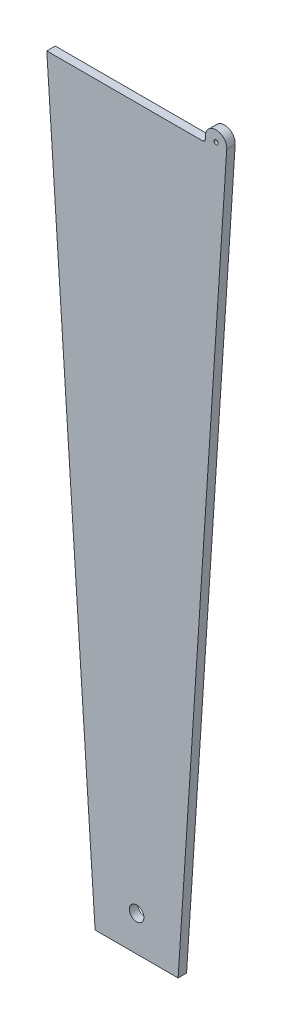
ISO-10303-21;
HEADER;
FILE_DESCRIPTION(('STEP AP214'),'2;1');
FILE_NAME('part.step','',(''),(''),'','','');
FILE_SCHEMA(('AUTOMOTIVE_DESIGN { 1 0 10303 214 1 1 1 1 }'));
ENDSEC;
DATA;
#1=APPLICATION_CONTEXT('core data for automotive mechanical design processes');
#2=APPLICATION_PROTOCOL_DEFINITION('international standard','automotive_design',2000,#1);
#3=PRODUCT_CONTEXT('',#1,'mechanical');
#4=PRODUCT('Part','Part','',(#3));
#5=PRODUCT_RELATED_PRODUCT_CATEGORY('part','',(#4));
#6=PRODUCT_DEFINITION_FORMATION('','',#4);
#7=PRODUCT_DEFINITION_CONTEXT('part definition',#1,'design');
#8=PRODUCT_DEFINITION('design','',#6,#7);
#9=PRODUCT_DEFINITION_SHAPE('','',#8);
#10=(LENGTH_UNIT() NAMED_UNIT(*) SI_UNIT(.MILLI.,.METRE.));
#11=(NAMED_UNIT(*) PLANE_ANGLE_UNIT() SI_UNIT($,.RADIAN.));
#12=(NAMED_UNIT(*) SI_UNIT($,.STERADIAN.) SOLID_ANGLE_UNIT());
#13=UNCERTAINTY_MEASURE_WITH_UNIT(LENGTH_MEASURE(1.E-05),#10,'distance_accuracy_value','');
#14=(GEOMETRIC_REPRESENTATION_CONTEXT(3) GLOBAL_UNCERTAINTY_ASSIGNED_CONTEXT((#13)) GLOBAL_UNIT_ASSIGNED_CONTEXT((#10,
#11,#12)) REPRESENTATION_CONTEXT('',''));
#15=CARTESIAN_POINT('',(0.,0.,0.));
#16=DIRECTION('',(0.,0.,1.));
#17=DIRECTION('',(1.,0.,0.));
#18=AXIS2_PLACEMENT_3D('',#15,#16,#17);
#19=CARTESIAN_POINT('',(16.5694114802251,171.,1.56));
#20=DIRECTION('',(-0.997858923238604,0.06540312923014,0.));
#21=DIRECTION('',(-0.06540312923014,-0.997858923238604,0.));
#22=AXIS2_PLACEMENT_3D('',#19,#20,#21);
#23=PLANE('',#22);
#24=DIRECTION('',(0.06540312923014,0.997858923238604,0.));
#25=VECTOR('',#24,1.);
#26=CARTESIAN_POINT('',(16.5694114802251,171.,0.));
#27=LINE('',#26,#25);
#28=CARTESIAN_POINT('',(7.6555005373531,35.,0.));
#29=VERTEX_POINT('',#28);
#30=CARTESIAN_POINT('',(16.6280593006424,171.894792827511,0.));
#31=VERTEX_POINT('',#30);
#32=EDGE_CURVE('E113',#29,#31,#27,.T.);
#33=ORIENTED_EDGE('',*,*,#32,.T.);
#34=DIRECTION('',(0.,0.,-1.));
#35=VECTOR('',#34,1.);
#36=CARTESIAN_POINT('',(16.6280593006424,171.894792827511,6.52163960974849));
#37=LINE('',#36,#35);
#38=CARTESIAN_POINT('',(16.6280593006424,171.894792827511,1.56));
#39=VERTEX_POINT('',#38);
#40=EDGE_CURVE('E103',#39,#31,#37,.T.);
#41=ORIENTED_EDGE('',*,*,#40,.F.);
#42=DIRECTION('',(0.06540312923014,0.997858923238604,0.));
#43=VECTOR('',#42,1.);
#44=CARTESIAN_POINT('',(16.5694114802251,171.,1.56));
#45=LINE('',#44,#43);
#46=CARTESIAN_POINT('',(7.6555005373531,35.,1.56));
#47=VERTEX_POINT('',#46);
#48=EDGE_CURVE('E99',#47,#39,#45,.T.);
#49=ORIENTED_EDGE('',*,*,#48,.F.);
#50=DIRECTION('',(0.,0.,-1.));
#51=VECTOR('',#50,1.);
#52=CARTESIAN_POINT('',(7.6555005373531,35.,1.56));
#53=LINE('',#52,#51);
#54=EDGE_CURVE('E139',#47,#29,#53,.T.);
#55=ORIENTED_EDGE('',*,*,#54,.T.);
#56=EDGE_LOOP('',(#33,#41,#49,#55));
#57=FACE_BOUND('',#56,.T.);
#58=ADVANCED_FACE('F30',(#57),#23,.F.);
#59=CARTESIAN_POINT('',(-16.5694114802251,171.,1.56));
#60=DIRECTION('',(0.,-1.,0.));
#61=DIRECTION('',(0.,0.,-1.));
#62=AXIS2_PLACEMENT_3D('',#59,#60,#61);
#63=PLANE('',#62);
#64=DIRECTION('',(-1.,0.,0.));
#65=VECTOR('',#64,1.);
#66=CARTESIAN_POINT('',(-16.5694114802251,171.,1.56));
#67=LINE('',#66,#65);
#68=CARTESIAN_POINT('',(12.18034522,171.,1.56));
#69=VERTEX_POINT('',#68);
#70=CARTESIAN_POINT('',(-16.5694114802251,171.,1.56));
#71=VERTEX_POINT('',#70);
#72=EDGE_CURVE('E118',#69,#71,#67,.T.);
#73=ORIENTED_EDGE('',*,*,#72,.F.);
#74=DIRECTION('',(0.,0.,-1.));
#75=VECTOR('',#74,1.);
#76=CARTESIAN_POINT('',(12.18034522,171.,1.56));
#77=LINE('',#76,#75);
#78=CARTESIAN_POINT('',(12.18034522,171.,0.));
#79=VERTEX_POINT('',#78);
#80=EDGE_CURVE('E133',#69,#79,#77,.T.);
#81=ORIENTED_EDGE('',*,*,#80,.T.);
#82=DIRECTION('',(-1.,0.,0.));
#83=VECTOR('',#82,1.);
#84=CARTESIAN_POINT('',(-16.5694114802251,171.,0.));
#85=LINE('',#84,#83);
#86=CARTESIAN_POINT('',(-16.5694114802251,171.,0.));
#87=VERTEX_POINT('',#86);
#88=EDGE_CURVE('E129',#79,#87,#85,.T.);
#89=ORIENTED_EDGE('',*,*,#88,.T.);
#90=DIRECTION('',(0.,0.,-1.));
#91=VECTOR('',#90,1.);
#92=CARTESIAN_POINT('',(-16.5694114802251,171.,1.56));
#93=LINE('',#92,#91);
#94=EDGE_CURVE('E146',#71,#87,#93,.T.);
#95=ORIENTED_EDGE('',*,*,#94,.F.);
#96=EDGE_LOOP('',(#73,#81,#89,#95));
#97=FACE_BOUND('',#96,.T.);
#98=ADVANCED_FACE('F157',(#97),#63,.F.);
#99=CARTESIAN_POINT('',(-16.5694114802251,171.,1.56));
#100=DIRECTION('',(0.997858923238604,0.06540312923014,0.));
#101=DIRECTION('',(-0.06540312923014,0.997858923238604,0.));
#102=AXIS2_PLACEMENT_3D('',#99,#100,#101);
#103=PLANE('',#102);
#104=DIRECTION('',(0.06540312923014,-0.997858923238604,0.));
#105=VECTOR('',#104,1.);
#106=CARTESIAN_POINT('',(-16.5694114802251,171.,0.));
#107=LINE('',#106,#105);
#108=CARTESIAN_POINT('',(-7.6555005373531,35.,0.));
#109=VERTEX_POINT('',#108);
#110=EDGE_CURVE('E132',#87,#109,#107,.T.);
#111=ORIENTED_EDGE('',*,*,#110,.T.);
#112=DIRECTION('',(0.,0.,-1.));
#113=VECTOR('',#112,1.);
#114=CARTESIAN_POINT('',(-7.6555005373531,35.,1.56));
#115=LINE('',#114,#113);
#116=CARTESIAN_POINT('',(-7.6555005373531,35.,1.56));
#117=VERTEX_POINT('',#116);
#118=EDGE_CURVE('E142',#117,#109,#115,.T.);
#119=ORIENTED_EDGE('',*,*,#118,.F.);
#120=DIRECTION('',(0.06540312923014,-0.997858923238604,0.));
#121=VECTOR('',#120,1.);
#122=CARTESIAN_POINT('',(-16.5694114802251,171.,1.56));
#123=LINE('',#122,#121);
#124=EDGE_CURVE('E122',#71,#117,#123,.T.);
#125=ORIENTED_EDGE('',*,*,#124,.F.);
#126=ORIENTED_EDGE('',*,*,#94,.T.);
#127=EDGE_LOOP('',(#111,#119,#125,#126));
#128=FACE_BOUND('',#127,.T.);
#129=ADVANCED_FACE('F166',(#128),#103,.F.);
#130=CARTESIAN_POINT('',(-7.6555005373531,35.,1.56));
#131=DIRECTION('',(0.,1.,0.));
#132=DIRECTION('',(0.,0.,1.));
#133=AXIS2_PLACEMENT_3D('',#130,#131,#132);
#134=PLANE('',#133);
#135=DIRECTION('',(1.,0.,0.));
#136=VECTOR('',#135,1.);
#137=CARTESIAN_POINT('',(-7.6555005373531,35.,0.));
#138=LINE('',#137,#136);
#139=EDGE_CURVE('E119',#109,#29,#138,.T.);
#140=ORIENTED_EDGE('',*,*,#139,.T.);
#141=ORIENTED_EDGE('',*,*,#54,.F.);
#142=DIRECTION('',(1.,0.,0.));
#143=VECTOR('',#142,1.);
#144=CARTESIAN_POINT('',(-7.6555005373531,35.,1.56));
#145=LINE('',#144,#143);
#146=EDGE_CURVE('E143',#117,#47,#145,.T.);
#147=ORIENTED_EDGE('',*,*,#146,.F.);
#148=ORIENTED_EDGE('',*,*,#118,.T.);
#149=EDGE_LOOP('',(#140,#141,#147,#148));
#150=FACE_BOUND('',#149,.T.);
#151=ADVANCED_FACE('F170',(#150),#134,.F.);
#152=CARTESIAN_POINT('',(16.5694114802251,171.,1.56));
#153=DIRECTION('',(0.,0.,1.));
#154=DIRECTION('',(1.,0.,0.));
#155=AXIS2_PLACEMENT_3D('',#152,#153,#154);
#156=PLANE('',#155);
#157=CARTESIAN_POINT('',(14.6563176146088,172.024027605391,1.56));
#158=DIRECTION('',(0.,0.,1.));
#159=DIRECTION('',(1.,0.,0.));
#160=AXIS2_PLACEMENT_3D('',#157,#158,#159);
#161=CIRCLE('',#160,0.396875000000007);
#162=CARTESIAN_POINT('',(15.0531926146088,172.024027605391,1.56));
#163=VERTEX_POINT('',#162);
#164=EDGE_CURVE('E281',#163,#163,#161,.T.);
#165=ORIENTED_EDGE('',*,*,#164,.F.);
#166=EDGE_LOOP('',(#165));
#167=FACE_BOUND('',#166,.T.);
#168=CARTESIAN_POINT('',(0.,41.5,1.56));
#169=DIRECTION('',(0.,0.,1.));
#170=DIRECTION('',(1.,0.,0.));
#171=AXIS2_PLACEMENT_3D('',#168,#169,#170);
#172=CIRCLE('',#171,1.34620000000001);
#173=CARTESIAN_POINT('',(1.34620000000001,41.5,1.56));
#174=VERTEX_POINT('',#173);
#175=EDGE_CURVE('E114',#174,#174,#172,.T.);
#176=ORIENTED_EDGE('',*,*,#175,.F.);
#177=EDGE_LOOP('',(#176));
#178=FACE_BOUND('',#177,.T.);
#179=ORIENTED_EDGE('',*,*,#48,.T.);
#180=CARTESIAN_POINT('',(14.6563176146088,172.024027605391,1.56));
#181=DIRECTION('',(0.,0.,1.));
#182=DIRECTION('',(1.,0.,0.));
#183=AXIS2_PLACEMENT_3D('',#180,#181,#182);
#184=CIRCLE('',#183,1.97597239460885);
#185=CARTESIAN_POINT('',(12.68034522,172.024027605391,1.56));
#186=VERTEX_POINT('',#185);
#187=EDGE_CURVE('E96',#186,#39,#184,.F.);
#188=ORIENTED_EDGE('',*,*,#187,.F.);
#189=DIRECTION('',(0.,1.,0.));
#190=VECTOR('',#189,1.);
#191=CARTESIAN_POINT('',(12.68034522,171.,1.56));
#192=LINE('',#191,#190);
#193=CARTESIAN_POINT('',(12.68034522,171.5,1.56));
#194=VERTEX_POINT('',#193);
#195=EDGE_CURVE('E85',#194,#186,#192,.T.);
#196=ORIENTED_EDGE('',*,*,#195,.F.);
#197=CARTESIAN_POINT('',(12.18034522,171.5,1.56));
#198=DIRECTION('',(0.,0.,1.));
#199=DIRECTION('',(1.,0.,0.));
#200=AXIS2_PLACEMENT_3D('',#197,#198,#199);
#201=CIRCLE('',#200,0.5);
#202=EDGE_CURVE('E11',#194,#69,#201,.F.);
#203=ORIENTED_EDGE('',*,*,#202,.T.);
#204=ORIENTED_EDGE('',*,*,#72,.T.);
#205=ORIENTED_EDGE('',*,*,#124,.T.);
#206=ORIENTED_EDGE('',*,*,#146,.T.);
#207=EDGE_LOOP('',(#179,#188,#196,#203,#204,#205,#206));
#208=FACE_BOUND('',#207,.T.);
#209=ADVANCED_FACE('F97',(#167,#178,#208),#156,.T.);
#210=CARTESIAN_POINT('',(16.5694114802251,171.,0.));
#211=DIRECTION('',(0.,0.,1.));
#212=DIRECTION('',(1.,0.,0.));
#213=AXIS2_PLACEMENT_3D('',#210,#211,#212);
#214=PLANE('',#213);
#215=CARTESIAN_POINT('',(14.6563176146088,172.024027605391,0.));
#216=DIRECTION('',(0.,0.,1.));
#217=DIRECTION('',(1.,0.,0.));
#218=AXIS2_PLACEMENT_3D('',#215,#216,#217);
#219=CIRCLE('',#218,0.396875000000007);
#220=CARTESIAN_POINT('',(15.0531926146088,172.024027605391,0.));
#221=VERTEX_POINT('',#220);
#222=EDGE_CURVE('E152',#221,#221,#219,.T.);
#223=ORIENTED_EDGE('',*,*,#222,.T.);
#224=EDGE_LOOP('',(#223));
#225=FACE_BOUND('',#224,.T.);
#226=CARTESIAN_POINT('',(0.,41.5,0.));
#227=DIRECTION('',(0.,0.,1.));
#228=DIRECTION('',(1.,0.,0.));
#229=AXIS2_PLACEMENT_3D('',#226,#227,#228);
#230=CIRCLE('',#229,1.34620000000001);
#231=CARTESIAN_POINT('',(1.34620000000001,41.5,0.));
#232=VERTEX_POINT('',#231);
#233=EDGE_CURVE('E110',#232,#232,#230,.T.);
#234=ORIENTED_EDGE('',*,*,#233,.T.);
#235=EDGE_LOOP('',(#234));
#236=FACE_BOUND('',#235,.T.);
#237=ORIENTED_EDGE('',*,*,#32,.F.);
#238=ORIENTED_EDGE('',*,*,#139,.F.);
#239=ORIENTED_EDGE('',*,*,#110,.F.);
#240=ORIENTED_EDGE('',*,*,#88,.F.);
#241=CARTESIAN_POINT('',(12.18034522,171.5,0.));
#242=DIRECTION('',(0.,0.,1.));
#243=DIRECTION('',(1.,0.,0.));
#244=AXIS2_PLACEMENT_3D('',#241,#242,#243);
#245=CIRCLE('',#244,0.5);
#246=CARTESIAN_POINT('',(12.68034522,171.5,0.));
#247=VERTEX_POINT('',#246);
#248=EDGE_CURVE('E38',#79,#247,#245,.T.);
#249=ORIENTED_EDGE('',*,*,#248,.T.);
#250=DIRECTION('',(0.,1.,0.));
#251=VECTOR('',#250,1.);
#252=CARTESIAN_POINT('',(12.68034522,171.,0.));
#253=LINE('',#252,#251);
#254=CARTESIAN_POINT('',(12.68034522,172.024027605391,0.));
#255=VERTEX_POINT('',#254);
#256=EDGE_CURVE('E150',#247,#255,#253,.T.);
#257=ORIENTED_EDGE('',*,*,#256,.T.);
#258=CARTESIAN_POINT('',(14.6563176146088,172.024027605391,0.));
#259=DIRECTION('',(0.,0.,-1.));
#260=DIRECTION('',(0.,1.,0.));
#261=AXIS2_PLACEMENT_3D('',#258,#259,#260);
#262=CIRCLE('',#261,1.97597239460885);
#263=EDGE_CURVE('E93',#255,#31,#262,.T.);
#264=ORIENTED_EDGE('',*,*,#263,.T.);
#265=EDGE_LOOP('',(#237,#238,#239,#240,#249,#257,#264));
#266=FACE_BOUND('',#265,.T.);
#267=ADVANCED_FACE('F162',(#225,#236,#266),#214,.F.);
#268=CARTESIAN_POINT('',(0.,41.5,0.));
#269=DIRECTION('',(0.,0.,1.));
#270=DIRECTION('',(1.,0.,0.));
#271=AXIS2_PLACEMENT_3D('',#268,#269,#270);
#272=CYLINDRICAL_SURFACE('',#271,1.34620000000001);
#273=ORIENTED_EDGE('',*,*,#233,.F.);
#274=EDGE_LOOP('',(#273));
#275=FACE_BOUND('',#274,.T.);
#276=ORIENTED_EDGE('',*,*,#175,.T.);
#277=EDGE_LOOP('',(#276));
#278=FACE_BOUND('',#277,.T.);
#279=ADVANCED_FACE('F194',(#275,#278),#272,.F.);
#280=CARTESIAN_POINT('',(12.68034522,171.,6.52163960974849));
#281=DIRECTION('',(-1.,0.,0.));
#282=DIRECTION('',(0.,-1.,0.));
#283=AXIS2_PLACEMENT_3D('',#280,#281,#282);
#284=PLANE('',#283);
#285=ORIENTED_EDGE('',*,*,#256,.F.);
#286=DIRECTION('',(0.,0.,-1.));
#287=VECTOR('',#286,1.);
#288=CARTESIAN_POINT('',(12.68034522,171.5,6.52163960974849));
#289=LINE('',#288,#287);
#290=EDGE_CURVE('E51',#247,#194,#289,.F.);
#291=ORIENTED_EDGE('',*,*,#290,.T.);
#292=ORIENTED_EDGE('',*,*,#195,.T.);
#293=DIRECTION('',(0.,0.,-1.));
#294=VECTOR('',#293,1.);
#295=CARTESIAN_POINT('',(12.68034522,172.024027605391,6.52163960974849));
#296=LINE('',#295,#294);
#297=EDGE_CURVE('E89',#186,#255,#296,.T.);
#298=ORIENTED_EDGE('',*,*,#297,.T.);
#299=EDGE_LOOP('',(#285,#291,#292,#298));
#300=FACE_BOUND('',#299,.T.);
#301=ADVANCED_FACE('F87',(#300),#284,.T.);
#302=CARTESIAN_POINT('',(14.6563176146088,172.024027605391,6.52163960974849));
#303=DIRECTION('',(0.,0.,-1.));
#304=DIRECTION('',(0.,1.,0.));
#305=AXIS2_PLACEMENT_3D('',#302,#303,#304);
#306=CYLINDRICAL_SURFACE('',#305,1.97597239460885);
#307=ORIENTED_EDGE('',*,*,#297,.F.);
#308=ORIENTED_EDGE('',*,*,#187,.T.);
#309=ORIENTED_EDGE('',*,*,#40,.T.);
#310=ORIENTED_EDGE('',*,*,#263,.F.);
#311=EDGE_LOOP('',(#307,#308,#309,#310));
#312=FACE_BOUND('',#311,.T.);
#313=ADVANCED_FACE('F105',(#312),#306,.T.);
#314=CARTESIAN_POINT('',(12.18034522,171.5,1.56));
#315=DIRECTION('',(0.,0.,-1.));
#316=DIRECTION('',(-1.,0.,0.));
#317=AXIS2_PLACEMENT_3D('',#314,#315,#316);
#318=CYLINDRICAL_SURFACE('',#317,0.5);
#319=ORIENTED_EDGE('',*,*,#202,.F.);
#320=ORIENTED_EDGE('',*,*,#290,.F.);
#321=ORIENTED_EDGE('',*,*,#248,.F.);
#322=ORIENTED_EDGE('',*,*,#80,.F.);
#323=EDGE_LOOP('',(#319,#320,#321,#322));
#324=FACE_BOUND('',#323,.T.);
#325=ADVANCED_FACE('F32',(#324),#318,.F.);
#326=CARTESIAN_POINT('',(14.6563176146088,172.024027605391,0.));
#327=DIRECTION('',(0.,0.,1.));
#328=DIRECTION('',(1.,0.,0.));
#329=AXIS2_PLACEMENT_3D('',#326,#327,#328);
#330=CYLINDRICAL_SURFACE('',#329,0.396875000000007);
#331=ORIENTED_EDGE('',*,*,#222,.F.);
#332=EDGE_LOOP('',(#331));
#333=FACE_BOUND('',#332,.T.);
#334=ORIENTED_EDGE('',*,*,#164,.T.);
#335=EDGE_LOOP('',(#334));
#336=FACE_BOUND('',#335,.T.);
#337=ADVANCED_FACE('F173',(#333,#336),#330,.F.);
#338=CLOSED_SHELL('',(#58,#98,#129,#151,#209,#267,#279,#301,#313,#325,#337));
#339=MANIFOLD_SOLID_BREP('B2',#338);
#340=ADVANCED_BREP_SHAPE_REPRESENTATION('',(#18,#339),#14);
#341=SHAPE_DEFINITION_REPRESENTATION(#9,#340);
ENDSEC;
END-ISO-10303-21;
